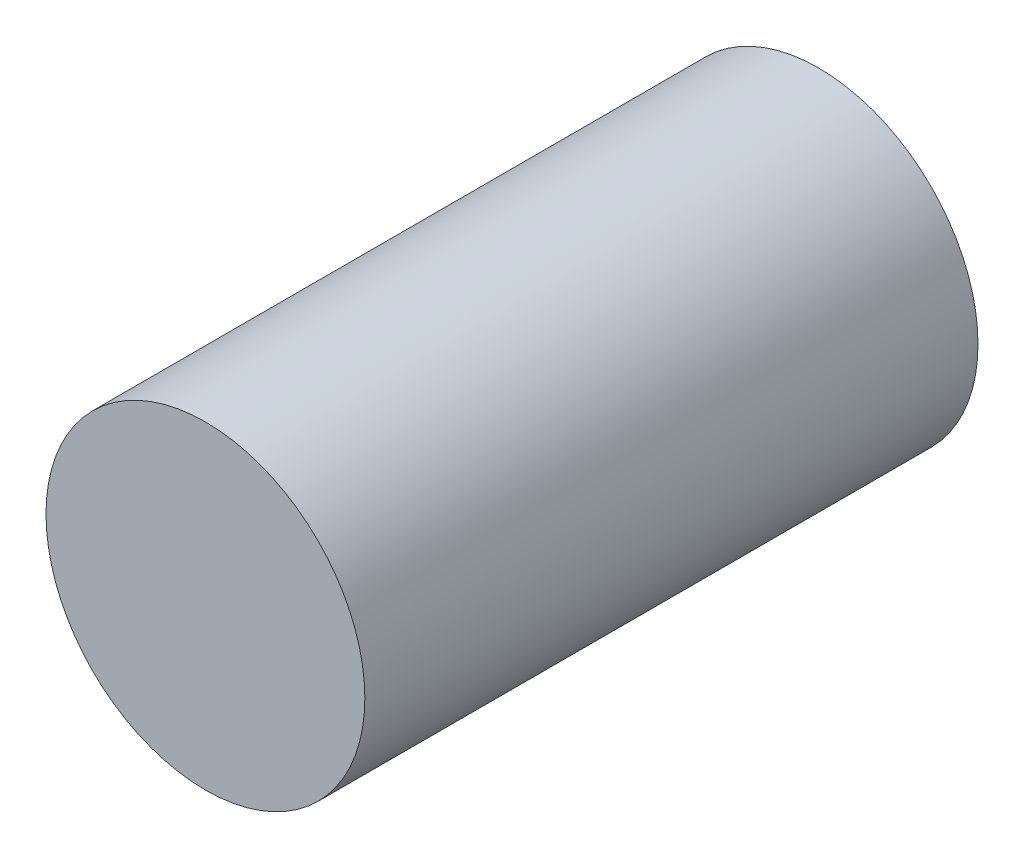
ISO-10303-21;
HEADER;
FILE_DESCRIPTION(('STEP AP214'),'2;1');
FILE_NAME('part.step','',(''),(''),'','','');
FILE_SCHEMA(('AUTOMOTIVE_DESIGN { 1 0 10303 214 1 1 1 1 }'));
ENDSEC;
DATA;
#1=APPLICATION_CONTEXT('core data for automotive mechanical design processes');
#2=APPLICATION_PROTOCOL_DEFINITION('international standard','automotive_design',2000,#1);
#3=PRODUCT_CONTEXT('',#1,'mechanical');
#4=PRODUCT('Part','Part','',(#3));
#5=PRODUCT_RELATED_PRODUCT_CATEGORY('part','',(#4));
#6=PRODUCT_DEFINITION_FORMATION('','',#4);
#7=PRODUCT_DEFINITION_CONTEXT('part definition',#1,'design');
#8=PRODUCT_DEFINITION('design','',#6,#7);
#9=PRODUCT_DEFINITION_SHAPE('','',#8);
#10=(LENGTH_UNIT() NAMED_UNIT(*) SI_UNIT(.MILLI.,.METRE.));
#11=(NAMED_UNIT(*) PLANE_ANGLE_UNIT() SI_UNIT($,.RADIAN.));
#12=(NAMED_UNIT(*) SI_UNIT($,.STERADIAN.) SOLID_ANGLE_UNIT());
#13=UNCERTAINTY_MEASURE_WITH_UNIT(LENGTH_MEASURE(1.E-05),#10,'distance_accuracy_value','');
#14=(GEOMETRIC_REPRESENTATION_CONTEXT(3) GLOBAL_UNCERTAINTY_ASSIGNED_CONTEXT((#13)) GLOBAL_UNIT_ASSIGNED_CONTEXT((#10,
#11,#12)) REPRESENTATION_CONTEXT('',''));
#15=CARTESIAN_POINT('',(0.,0.,0.));
#16=DIRECTION('',(0.,0.,1.));
#17=DIRECTION('',(1.,0.,0.));
#18=AXIS2_PLACEMENT_3D('',#15,#16,#17);
#19=CARTESIAN_POINT('',(1.29999994,0.,0.));
#20=DIRECTION('',(0.,0.,-1.));
#21=DIRECTION('',(-1.,0.,0.));
#22=AXIS2_PLACEMENT_3D('',#19,#20,#21);
#23=PLANE('',#22);
#24=CARTESIAN_POINT('',(0.,0.,0.));
#25=DIRECTION('',(0.,0.,-1.));
#26=DIRECTION('',(-1.,0.,0.));
#27=AXIS2_PLACEMENT_3D('',#24,#25,#26);
#28=CIRCLE('',#27,1.29999994);
#29=CARTESIAN_POINT('',(-1.29999994,0.,0.));
#30=VERTEX_POINT('',#29);
#31=EDGE_CURVE('E18',#30,#30,#28,.F.);
#32=ORIENTED_EDGE('',*,*,#31,.F.);
#33=EDGE_LOOP('',(#32));
#34=FACE_BOUND('',#33,.T.);
#35=ADVANCED_FACE('F15',(#34),#23,.T.);
#36=CARTESIAN_POINT('',(1.29999994,0.,5.00000016));
#37=DIRECTION('',(0.,0.,-1.));
#38=DIRECTION('',(-1.,0.,0.));
#39=AXIS2_PLACEMENT_3D('',#36,#37,#38);
#40=PLANE('',#39);
#41=CARTESIAN_POINT('',(0.,0.,5.00000016));
#42=DIRECTION('',(0.,0.,-1.));
#43=DIRECTION('',(-1.,0.,0.));
#44=AXIS2_PLACEMENT_3D('',#41,#42,#43);
#45=CIRCLE('',#44,1.29999994);
#46=CARTESIAN_POINT('',(-1.29999994,0.,5.00000016));
#47=VERTEX_POINT('',#46);
#48=EDGE_CURVE('E10',#47,#47,#45,.T.);
#49=ORIENTED_EDGE('',*,*,#48,.F.);
#50=EDGE_LOOP('',(#49));
#51=FACE_BOUND('',#50,.T.);
#52=ADVANCED_FACE('F30',(#51),#40,.F.);
#53=CARTESIAN_POINT('',(0.,0.,0.));
#54=DIRECTION('',(0.,0.,-1.));
#55=DIRECTION('',(-1.,0.,0.));
#56=AXIS2_PLACEMENT_3D('',#53,#54,#55);
#57=CYLINDRICAL_SURFACE('',#56,1.29999994);
#58=ORIENTED_EDGE('',*,*,#48,.T.);
#59=EDGE_LOOP('',(#58));
#60=FACE_BOUND('',#59,.T.);
#61=ORIENTED_EDGE('',*,*,#31,.T.);
#62=EDGE_LOOP('',(#61));
#63=FACE_BOUND('',#62,.T.);
#64=ADVANCED_FACE('F27',(#60,#63),#57,.T.);
#65=CLOSED_SHELL('',(#35,#52,#64));
#66=MANIFOLD_SOLID_BREP('B1',#65);
#67=ADVANCED_BREP_SHAPE_REPRESENTATION('',(#18,#66),#14);
#68=SHAPE_DEFINITION_REPRESENTATION(#9,#67);
ENDSEC;
END-ISO-10303-21;
